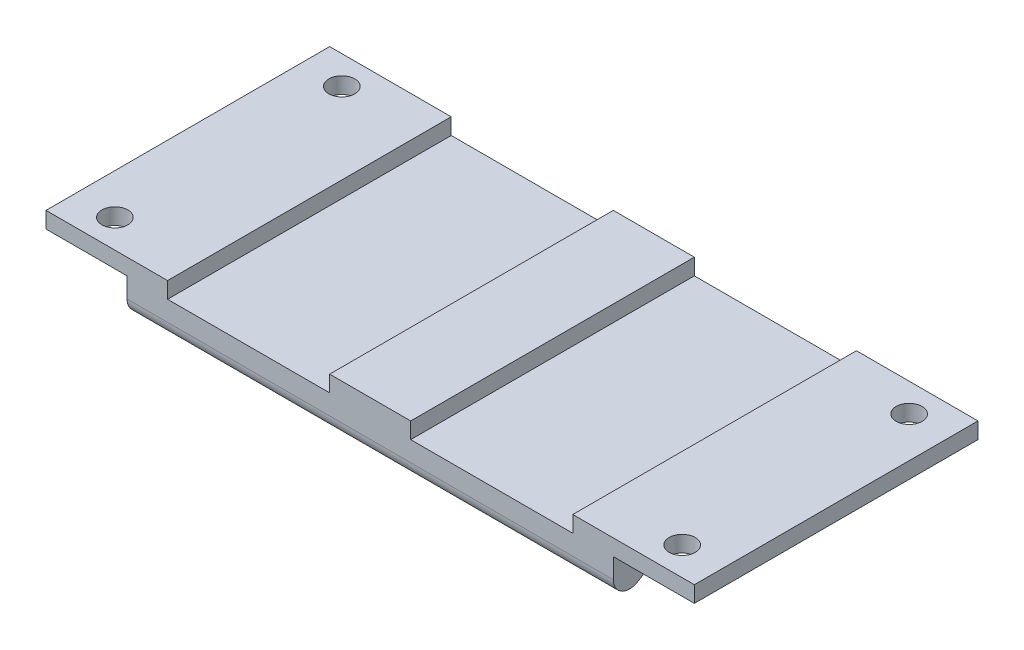
ISO-10303-21;
HEADER;
FILE_DESCRIPTION(('STEP AP214'),'2;1');
FILE_NAME('part.step','',(''),(''),'','','');
FILE_SCHEMA(('AUTOMOTIVE_DESIGN { 1 0 10303 214 1 1 1 1 }'));
ENDSEC;
DATA;
#1=APPLICATION_CONTEXT('core data for automotive mechanical design processes');
#2=APPLICATION_PROTOCOL_DEFINITION('international standard','automotive_design',2000,#1);
#3=PRODUCT_CONTEXT('',#1,'mechanical');
#4=PRODUCT('Part','Part','',(#3));
#5=PRODUCT_RELATED_PRODUCT_CATEGORY('part','',(#4));
#6=PRODUCT_DEFINITION_FORMATION('','',#4);
#7=PRODUCT_DEFINITION_CONTEXT('part definition',#1,'design');
#8=PRODUCT_DEFINITION('design','',#6,#7);
#9=PRODUCT_DEFINITION_SHAPE('','',#8);
#10=(LENGTH_UNIT() NAMED_UNIT(*) SI_UNIT(.MILLI.,.METRE.));
#11=(NAMED_UNIT(*) PLANE_ANGLE_UNIT() SI_UNIT($,.RADIAN.));
#12=(NAMED_UNIT(*) SI_UNIT($,.STERADIAN.) SOLID_ANGLE_UNIT());
#13=UNCERTAINTY_MEASURE_WITH_UNIT(LENGTH_MEASURE(1.E-05),#10,'distance_accuracy_value','');
#14=(GEOMETRIC_REPRESENTATION_CONTEXT(3) GLOBAL_UNCERTAINTY_ASSIGNED_CONTEXT((#13)) GLOBAL_UNIT_ASSIGNED_CONTEXT((#10,
#11,#12)) REPRESENTATION_CONTEXT('',''));
#15=CARTESIAN_POINT('',(0.,0.,0.));
#16=DIRECTION('',(0.,0.,1.));
#17=DIRECTION('',(1.,0.,0.));
#18=AXIS2_PLACEMENT_3D('',#15,#16,#17);
#19=CARTESIAN_POINT('',(0.,0.,0.));
#20=DIRECTION('',(0.,1.,0.));
#21=DIRECTION('',(0.,0.,1.));
#22=AXIS2_PLACEMENT_3D('',#19,#20,#21);
#23=PLANE('',#22);
#24=DIRECTION('',(-1.,0.,0.));
#25=VECTOR('',#24,1.);
#26=CARTESIAN_POINT('',(30.,0.,-17.5));
#27=LINE('',#26,#25);
#28=CARTESIAN_POINT('',(40.,0.,-17.5));
#29=VERTEX_POINT('',#28);
#30=CARTESIAN_POINT('',(25.,0.,-17.5));
#31=VERTEX_POINT('',#30);
#32=EDGE_CURVE('E188',#29,#31,#27,.T.);
#33=ORIENTED_EDGE('',*,*,#32,.T.);
#34=DIRECTION('',(0.,0.,1.));
#35=VECTOR('',#34,1.);
#36=CARTESIAN_POINT('',(25.,0.,-17.5));
#37=LINE('',#36,#35);
#38=CARTESIAN_POINT('',(25.,0.,17.5));
#39=VERTEX_POINT('',#38);
#40=EDGE_CURVE('E278',#31,#39,#37,.T.);
#41=ORIENTED_EDGE('',*,*,#40,.T.);
#42=DIRECTION('',(1.,0.,0.));
#43=VECTOR('',#42,1.);
#44=CARTESIAN_POINT('',(30.,0.,17.5));
#45=LINE('',#44,#43);
#46=CARTESIAN_POINT('',(40.,0.,17.5));
#47=VERTEX_POINT('',#46);
#48=EDGE_CURVE('E214',#39,#47,#45,.T.);
#49=ORIENTED_EDGE('',*,*,#48,.T.);
#50=DIRECTION('',(0.,0.,-1.));
#51=VECTOR('',#50,1.);
#52=CARTESIAN_POINT('',(40.,0.,0.));
#53=LINE('',#52,#51);
#54=EDGE_CURVE('E207',#47,#29,#53,.T.);
#55=ORIENTED_EDGE('',*,*,#54,.T.);
#56=EDGE_LOOP('',(#33,#41,#49,#55));
#57=FACE_BOUND('',#56,.T.);
#58=CARTESIAN_POINT('',(35.,0.,14.));
#59=DIRECTION('',(0.,1.,0.));
#60=DIRECTION('',(0.,0.,1.));
#61=AXIS2_PLACEMENT_3D('',#58,#59,#60);
#62=CIRCLE('',#61,1.6);
#63=CARTESIAN_POINT('',(35.,0.,15.6));
#64=VERTEX_POINT('',#63);
#65=EDGE_CURVE('E687',#64,#64,#62,.T.);
#66=ORIENTED_EDGE('',*,*,#65,.F.);
#67=EDGE_LOOP('',(#66));
#68=FACE_BOUND('',#67,.T.);
#69=CARTESIAN_POINT('',(35.,0.,-14.));
#70=DIRECTION('',(0.,1.,0.));
#71=DIRECTION('',(0.,0.,1.));
#72=AXIS2_PLACEMENT_3D('',#69,#70,#71);
#73=CIRCLE('',#72,1.6);
#74=CARTESIAN_POINT('',(35.,0.,-12.4));
#75=VERTEX_POINT('',#74);
#76=EDGE_CURVE('E683',#75,#75,#73,.F.);
#77=ORIENTED_EDGE('',*,*,#76,.T.);
#78=EDGE_LOOP('',(#77));
#79=FACE_BOUND('',#78,.T.);
#80=ADVANCED_FACE('F35',(#57,#68,#79),#23,.T.);
#81=DIRECTION('',(0.,0.,1.));
#82=VECTOR('',#81,1.);
#83=CARTESIAN_POINT('',(-25.,0.,-17.5));
#84=LINE('',#83,#82);
#85=CARTESIAN_POINT('',(-25.,0.,-17.5));
#86=VERTEX_POINT('',#85);
#87=CARTESIAN_POINT('',(-25.,0.,17.5));
#88=VERTEX_POINT('',#87);
#89=EDGE_CURVE('E267',#86,#88,#84,.T.);
#90=ORIENTED_EDGE('',*,*,#89,.F.);
#91=CARTESIAN_POINT('',(-40.,0.,-17.5));
#92=VERTEX_POINT('',#91);
#93=EDGE_CURVE('E202',#86,#92,#27,.T.);
#94=ORIENTED_EDGE('',*,*,#93,.T.);
#95=DIRECTION('',(0.,0.,-1.));
#96=VECTOR('',#95,1.);
#97=CARTESIAN_POINT('',(-40.,0.,0.));
#98=LINE('',#97,#96);
#99=CARTESIAN_POINT('',(-40.,0.,17.5));
#100=VERTEX_POINT('',#99);
#101=EDGE_CURVE('E233',#100,#92,#98,.T.);
#102=ORIENTED_EDGE('',*,*,#101,.F.);
#103=EDGE_CURVE('E307',#100,#88,#45,.T.);
#104=ORIENTED_EDGE('',*,*,#103,.T.);
#105=EDGE_LOOP('',(#90,#94,#102,#104));
#106=FACE_BOUND('',#105,.T.);
#107=CARTESIAN_POINT('',(-35.,0.,-14.));
#108=DIRECTION('',(0.,1.,0.));
#109=DIRECTION('',(0.,0.,1.));
#110=AXIS2_PLACEMENT_3D('',#107,#108,#109);
#111=CIRCLE('',#110,1.6);
#112=CARTESIAN_POINT('',(-35.,0.,-12.4));
#113=VERTEX_POINT('',#112);
#114=EDGE_CURVE('E360',#113,#113,#111,.T.);
#115=ORIENTED_EDGE('',*,*,#114,.F.);
#116=EDGE_LOOP('',(#115));
#117=FACE_BOUND('',#116,.T.);
#118=CARTESIAN_POINT('',(-35.,0.,14.));
#119=DIRECTION('',(0.,1.,0.));
#120=DIRECTION('',(0.,0.,1.));
#121=AXIS2_PLACEMENT_3D('',#118,#119,#120);
#122=CIRCLE('',#121,1.6);
#123=CARTESIAN_POINT('',(-35.,0.,15.6));
#124=VERTEX_POINT('',#123);
#125=EDGE_CURVE('E681',#124,#124,#122,.F.);
#126=ORIENTED_EDGE('',*,*,#125,.T.);
#127=EDGE_LOOP('',(#126));
#128=FACE_BOUND('',#127,.T.);
#129=ADVANCED_FACE('F374',(#106,#117,#128),#23,.T.);
#130=CARTESIAN_POINT('',(-40.,-2.,0.));
#131=DIRECTION('',(0.,1.,0.));
#132=DIRECTION('',(0.,0.,1.));
#133=AXIS2_PLACEMENT_3D('',#130,#131,#132);
#134=PLANE('',#133);
#135=CARTESIAN_POINT('',(-35.,-2.,-14.));
#136=DIRECTION('',(0.,1.,0.));
#137=DIRECTION('',(0.,0.,1.));
#138=AXIS2_PLACEMENT_3D('',#135,#136,#137);
#139=CIRCLE('',#138,1.6);
#140=CARTESIAN_POINT('',(-35.,-2.,-12.4));
#141=VERTEX_POINT('',#140);
#142=EDGE_CURVE('E362',#141,#141,#139,.T.);
#143=ORIENTED_EDGE('',*,*,#142,.T.);
#144=EDGE_LOOP('',(#143));
#145=FACE_BOUND('',#144,.T.);
#146=DIRECTION('',(0.,0.,1.));
#147=VECTOR('',#146,1.);
#148=CARTESIAN_POINT('',(-30.,-2.,0.));
#149=LINE('',#148,#147);
#150=CARTESIAN_POINT('',(-30.,-2.,-17.5));
#151=VERTEX_POINT('',#150);
#152=CARTESIAN_POINT('',(-30.,-2.,17.5));
#153=VERTEX_POINT('',#152);
#154=EDGE_CURVE('E60',#151,#153,#149,.T.);
#155=ORIENTED_EDGE('',*,*,#154,.T.);
#156=DIRECTION('',(1.,0.,0.));
#157=VECTOR('',#156,1.);
#158=CARTESIAN_POINT('',(-40.,-2.,17.5));
#159=LINE('',#158,#157);
#160=CARTESIAN_POINT('',(-40.,-2.,17.5));
#161=VERTEX_POINT('',#160);
#162=EDGE_CURVE('E236',#161,#153,#159,.T.);
#163=ORIENTED_EDGE('',*,*,#162,.F.);
#164=DIRECTION('',(0.,0.,1.));
#165=VECTOR('',#164,1.);
#166=CARTESIAN_POINT('',(-40.,-2.,0.));
#167=LINE('',#166,#165);
#168=CARTESIAN_POINT('',(-40.,-2.,-17.5));
#169=VERTEX_POINT('',#168);
#170=EDGE_CURVE('E228',#169,#161,#167,.T.);
#171=ORIENTED_EDGE('',*,*,#170,.F.);
#172=DIRECTION('',(1.,0.,0.));
#173=VECTOR('',#172,1.);
#174=CARTESIAN_POINT('',(-40.,-2.,-17.5));
#175=LINE('',#174,#173);
#176=EDGE_CURVE('E240',#169,#151,#175,.T.);
#177=ORIENTED_EDGE('',*,*,#176,.T.);
#178=EDGE_LOOP('',(#155,#163,#171,#177));
#179=FACE_BOUND('',#178,.T.);
#180=CARTESIAN_POINT('',(-35.,-2.,14.));
#181=DIRECTION('',(0.,1.,0.));
#182=DIRECTION('',(0.,0.,1.));
#183=AXIS2_PLACEMENT_3D('',#180,#181,#182);
#184=CIRCLE('',#183,1.6);
#185=CARTESIAN_POINT('',(-35.,-2.,15.6));
#186=VERTEX_POINT('',#185);
#187=EDGE_CURVE('E39',#186,#186,#184,.F.);
#188=ORIENTED_EDGE('',*,*,#187,.F.);
#189=EDGE_LOOP('',(#188));
#190=FACE_BOUND('',#189,.T.);
#191=ADVANCED_FACE('F371',(#145,#179,#190),#134,.F.);
#192=CARTESIAN_POINT('',(40.,-2.,0.));
#193=DIRECTION('',(0.,-1.,0.));
#194=DIRECTION('',(0.,0.,-1.));
#195=AXIS2_PLACEMENT_3D('',#192,#193,#194);
#196=PLANE('',#195);
#197=DIRECTION('',(0.,0.,1.));
#198=VECTOR('',#197,1.);
#199=CARTESIAN_POINT('',(30.,-2.,0.));
#200=LINE('',#199,#198);
#201=CARTESIAN_POINT('',(30.,-2.,-17.5));
#202=VERTEX_POINT('',#201);
#203=CARTESIAN_POINT('',(30.,-2.,17.5));
#204=VERTEX_POINT('',#203);
#205=EDGE_CURVE('E210',#202,#204,#200,.T.);
#206=ORIENTED_EDGE('',*,*,#205,.F.);
#207=DIRECTION('',(-1.,0.,0.));
#208=VECTOR('',#207,1.);
#209=CARTESIAN_POINT('',(40.,-2.,-17.5));
#210=LINE('',#209,#208);
#211=CARTESIAN_POINT('',(40.,-2.,-17.5));
#212=VERTEX_POINT('',#211);
#213=EDGE_CURVE('E221',#212,#202,#210,.T.);
#214=ORIENTED_EDGE('',*,*,#213,.F.);
#215=DIRECTION('',(0.,0.,1.));
#216=VECTOR('',#215,1.);
#217=CARTESIAN_POINT('',(40.,-2.,0.));
#218=LINE('',#217,#216);
#219=CARTESIAN_POINT('',(40.,-2.,17.5));
#220=VERTEX_POINT('',#219);
#221=EDGE_CURVE('E209',#212,#220,#218,.T.);
#222=ORIENTED_EDGE('',*,*,#221,.T.);
#223=DIRECTION('',(-1.,0.,0.));
#224=VECTOR('',#223,1.);
#225=CARTESIAN_POINT('',(40.,-2.,17.5));
#226=LINE('',#225,#224);
#227=EDGE_CURVE('E52',#220,#204,#226,.T.);
#228=ORIENTED_EDGE('',*,*,#227,.T.);
#229=EDGE_LOOP('',(#206,#214,#222,#228));
#230=FACE_BOUND('',#229,.T.);
#231=CARTESIAN_POINT('',(35.,-2.,14.));
#232=DIRECTION('',(0.,-1.,0.));
#233=DIRECTION('',(0.,0.,-1.));
#234=AXIS2_PLACEMENT_3D('',#231,#232,#233);
#235=CIRCLE('',#234,1.6);
#236=CARTESIAN_POINT('',(35.,-2.,12.4));
#237=VERTEX_POINT('',#236);
#238=EDGE_CURVE('E356',#237,#237,#235,.T.);
#239=ORIENTED_EDGE('',*,*,#238,.F.);
#240=EDGE_LOOP('',(#239));
#241=FACE_BOUND('',#240,.T.);
#242=CARTESIAN_POINT('',(35.,-2.,-14.));
#243=DIRECTION('',(0.,-1.,0.));
#244=DIRECTION('',(0.,0.,-1.));
#245=AXIS2_PLACEMENT_3D('',#242,#243,#244);
#246=CIRCLE('',#245,1.6);
#247=CARTESIAN_POINT('',(35.,-2.,-15.6));
#248=VERTEX_POINT('',#247);
#249=EDGE_CURVE('E359',#248,#248,#246,.F.);
#250=ORIENTED_EDGE('',*,*,#249,.T.);
#251=EDGE_LOOP('',(#250));
#252=FACE_BOUND('',#251,.T.);
#253=ADVANCED_FACE('F373',(#230,#241,#252),#196,.T.);
#254=CARTESIAN_POINT('',(30.,-8.,17.5));
#255=DIRECTION('',(1.,0.,0.));
#256=DIRECTION('',(0.,0.,-1.));
#257=AXIS2_PLACEMENT_3D('',#254,#255,#256);
#258=PLANE('',#257);
#259=DIRECTION('',(0.,1.,0.));
#260=VECTOR('',#259,1.);
#261=CARTESIAN_POINT('',(30.,-8.,-17.5));
#262=LINE('',#261,#260);
#263=CARTESIAN_POINT('',(30.,-4.46761924206188,-17.5));
#264=VERTEX_POINT('',#263);
#265=EDGE_CURVE('E314',#264,#202,#262,.T.);
#266=ORIENTED_EDGE('',*,*,#265,.T.);
#267=ORIENTED_EDGE('',*,*,#205,.T.);
#268=DIRECTION('',(0.,1.,0.));
#269=VECTOR('',#268,1.);
#270=CARTESIAN_POINT('',(30.,-8.,17.5));
#271=LINE('',#270,#269);
#272=CARTESIAN_POINT('',(30.,-4.46761924206188,17.5));
#273=VERTEX_POINT('',#272);
#274=EDGE_CURVE('E317',#273,#204,#271,.T.);
#275=ORIENTED_EDGE('',*,*,#274,.F.);
#276=CARTESIAN_POINT('',(30.,-4.46761924206188,15.5));
#277=DIRECTION('',(1.,0.,0.));
#278=DIRECTION('',(0.,0.,-1.));
#279=AXIS2_PLACEMENT_3D('',#276,#277,#278);
#280=CIRCLE('',#279,2.);
#281=CARTESIAN_POINT('',(30.,-6.18260509348697,14.4710084891449));
#282=VERTEX_POINT('',#281);
#283=EDGE_CURVE('E344',#273,#282,#280,.T.);
#284=ORIENTED_EDGE('',*,*,#283,.T.);
#285=DIRECTION('',(0.,0.514495755427526,-0.857492925712544));
#286=VECTOR('',#285,1.);
#287=CARTESIAN_POINT('',(30.,-8.,17.5));
#288=LINE('',#287,#286);
#289=CARTESIAN_POINT('',(30.,-5.28501414857491,12.9750235809582));
#290=VERTEX_POINT('',#289);
#291=EDGE_CURVE('E304',#282,#290,#288,.T.);
#292=ORIENTED_EDGE('',*,*,#291,.T.);
#293=CARTESIAN_POINT('',(30.,-7.,11.9460320701031));
#294=DIRECTION('',(1.,0.,0.));
#295=DIRECTION('',(0.,0.,-1.));
#296=AXIS2_PLACEMENT_3D('',#293,#294,#295);
#297=CIRCLE('',#296,2.);
#298=CARTESIAN_POINT('',(30.,-5.,11.9460320701031));
#299=VERTEX_POINT('',#298);
#300=EDGE_CURVE('E351',#290,#299,#297,.F.);
#301=ORIENTED_EDGE('',*,*,#300,.T.);
#302=DIRECTION('',(0.,0.,-1.));
#303=VECTOR('',#302,1.);
#304=CARTESIAN_POINT('',(30.,-5.,17.5));
#305=LINE('',#304,#303);
#306=CARTESIAN_POINT('',(30.,-5.,-11.9460320701031));
#307=VERTEX_POINT('',#306);
#308=EDGE_CURVE('E313',#299,#307,#305,.T.);
#309=ORIENTED_EDGE('',*,*,#308,.T.);
#310=CARTESIAN_POINT('',(30.,-7.,-11.9460320701031));
#311=DIRECTION('',(1.,0.,0.));
#312=DIRECTION('',(0.,0.,-1.));
#313=AXIS2_PLACEMENT_3D('',#310,#311,#312);
#314=CIRCLE('',#313,2.);
#315=CARTESIAN_POINT('',(30.,-5.28501414857491,-12.9750235809582));
#316=VERTEX_POINT('',#315);
#317=EDGE_CURVE('E44',#307,#316,#314,.F.);
#318=ORIENTED_EDGE('',*,*,#317,.T.);
#319=DIRECTION('',(0.,0.514495755427527,0.857492925712544));
#320=VECTOR('',#319,1.);
#321=CARTESIAN_POINT('',(30.,7.44117647058825,8.23529411764705));
#322=LINE('',#321,#320);
#323=CARTESIAN_POINT('',(30.,-6.18260509348696,-14.471008489145));
#324=VERTEX_POINT('',#323);
#325=EDGE_CURVE('E301',#324,#316,#322,.T.);
#326=ORIENTED_EDGE('',*,*,#325,.F.);
#327=CARTESIAN_POINT('',(30.,-4.46761924206188,-15.5));
#328=DIRECTION('',(1.,0.,0.));
#329=DIRECTION('',(0.,0.,-1.));
#330=AXIS2_PLACEMENT_3D('',#327,#328,#329);
#331=CIRCLE('',#330,2.);
#332=EDGE_CURVE('E346',#324,#264,#331,.T.);
#333=ORIENTED_EDGE('',*,*,#332,.T.);
#334=EDGE_LOOP('',(#266,#267,#275,#284,#292,#301,#309,#318,#326,#333));
#335=FACE_BOUND('',#334,.T.);
#336=ADVANCED_FACE('F380',(#335),#258,.T.);
#337=CARTESIAN_POINT('',(30.,-8.,-17.5));
#338=DIRECTION('',(0.,0.,-1.));
#339=DIRECTION('',(-1.,0.,0.));
#340=AXIS2_PLACEMENT_3D('',#337,#338,#339);
#341=PLANE('',#340);
#342=DIRECTION('',(1.,0.,0.));
#343=VECTOR('',#342,1.);
#344=CARTESIAN_POINT('',(0.,-2.,-17.5));
#345=LINE('',#344,#343);
#346=CARTESIAN_POINT('',(-25.,-2.,-17.5));
#347=VERTEX_POINT('',#346);
#348=CARTESIAN_POINT('',(-4.99999999999999,-2.,-17.5));
#349=VERTEX_POINT('',#348);
#350=EDGE_CURVE('E250',#347,#349,#345,.T.);
#351=ORIENTED_EDGE('',*,*,#350,.T.);
#352=DIRECTION('',(0.,-1.,0.));
#353=VECTOR('',#352,1.);
#354=CARTESIAN_POINT('',(-5.,0.,-17.5));
#355=LINE('',#354,#353);
#356=CARTESIAN_POINT('',(-5.,0.,-17.5));
#357=VERTEX_POINT('',#356);
#358=EDGE_CURVE('E244',#357,#349,#355,.T.);
#359=ORIENTED_EDGE('',*,*,#358,.F.);
#360=CARTESIAN_POINT('',(5.,0.,-17.5));
#361=VERTEX_POINT('',#360);
#362=EDGE_CURVE('E200',#361,#357,#27,.T.);
#363=ORIENTED_EDGE('',*,*,#362,.F.);
#364=DIRECTION('',(0.,-1.,0.));
#365=VECTOR('',#364,1.);
#366=CARTESIAN_POINT('',(5.,0.,-17.5));
#367=LINE('',#366,#365);
#368=CARTESIAN_POINT('',(5.,-2.,-17.5));
#369=VERTEX_POINT('',#368);
#370=EDGE_CURVE('E272',#361,#369,#367,.T.);
#371=ORIENTED_EDGE('',*,*,#370,.T.);
#372=DIRECTION('',(-1.,0.,0.));
#373=VECTOR('',#372,1.);
#374=CARTESIAN_POINT('',(0.,-2.,-17.5));
#375=LINE('',#374,#373);
#376=CARTESIAN_POINT('',(25.,-1.99999999999999,-17.5));
#377=VERTEX_POINT('',#376);
#378=EDGE_CURVE('E276',#377,#369,#375,.T.);
#379=ORIENTED_EDGE('',*,*,#378,.F.);
#380=DIRECTION('',(0.,-1.,0.));
#381=VECTOR('',#380,1.);
#382=CARTESIAN_POINT('',(25.,0.,-17.5));
#383=LINE('',#382,#381);
#384=EDGE_CURVE('E195',#31,#377,#383,.T.);
#385=ORIENTED_EDGE('',*,*,#384,.F.);
#386=ORIENTED_EDGE('',*,*,#32,.F.);
#387=DIRECTION('',(0.,-1.,0.));
#388=VECTOR('',#387,1.);
#389=CARTESIAN_POINT('',(40.,0.,-17.5));
#390=LINE('',#389,#388);
#391=EDGE_CURVE('E192',#29,#212,#390,.T.);
#392=ORIENTED_EDGE('',*,*,#391,.T.);
#393=ORIENTED_EDGE('',*,*,#213,.T.);
#394=ORIENTED_EDGE('',*,*,#265,.F.);
#395=DIRECTION('',(-1.,0.,0.));
#396=VECTOR('',#395,1.);
#397=CARTESIAN_POINT('',(-30.,-4.46761924206187,-17.5));
#398=LINE('',#397,#396);
#399=CARTESIAN_POINT('',(-30.,-4.46761924206187,-17.5));
#400=VERTEX_POINT('',#399);
#401=EDGE_CURVE('E337',#264,#400,#398,.T.);
#402=ORIENTED_EDGE('',*,*,#401,.T.);
#403=DIRECTION('',(0.,1.,0.));
#404=VECTOR('',#403,1.);
#405=CARTESIAN_POINT('',(-30.,-8.,-17.5));
#406=LINE('',#405,#404);
#407=EDGE_CURVE('E311',#400,#151,#406,.T.);
#408=ORIENTED_EDGE('',*,*,#407,.T.);
#409=ORIENTED_EDGE('',*,*,#176,.F.);
#410=DIRECTION('',(0.,-1.,0.));
#411=VECTOR('',#410,1.);
#412=CARTESIAN_POINT('',(-40.,0.,-17.5));
#413=LINE('',#412,#411);
#414=EDGE_CURVE('E225',#92,#169,#413,.T.);
#415=ORIENTED_EDGE('',*,*,#414,.F.);
#416=ORIENTED_EDGE('',*,*,#93,.F.);
#417=DIRECTION('',(0.,-1.,0.));
#418=VECTOR('',#417,1.);
#419=CARTESIAN_POINT('',(-25.,0.,-17.5));
#420=LINE('',#419,#418);
#421=EDGE_CURVE('E246',#86,#347,#420,.T.);
#422=ORIENTED_EDGE('',*,*,#421,.T.);
#423=EDGE_LOOP('',(#351,#359,#363,#371,#379,#385,#386,#392,#393,#394,#402,#408,#409,#415,#416,#422));
#424=FACE_BOUND('',#423,.T.);
#425=ADVANCED_FACE('F191',(#424),#341,.T.);
#426=CARTESIAN_POINT('',(30.,-8.,17.5));
#427=DIRECTION('',(0.,0.,1.));
#428=DIRECTION('',(1.,0.,0.));
#429=AXIS2_PLACEMENT_3D('',#426,#427,#428);
#430=PLANE('',#429);
#431=CARTESIAN_POINT('',(-5.,0.,17.5));
#432=VERTEX_POINT('',#431);
#433=CARTESIAN_POINT('',(5.,0.,17.5));
#434=VERTEX_POINT('',#433);
#435=EDGE_CURVE('E309',#432,#434,#45,.T.);
#436=ORIENTED_EDGE('',*,*,#435,.F.);
#437=DIRECTION('',(0.,-1.,0.));
#438=VECTOR('',#437,1.);
#439=CARTESIAN_POINT('',(-5.,0.,17.5));
#440=LINE('',#439,#438);
#441=CARTESIAN_POINT('',(-4.99999999999999,-2.,17.5));
#442=VERTEX_POINT('',#441);
#443=EDGE_CURVE('E253',#432,#442,#440,.T.);
#444=ORIENTED_EDGE('',*,*,#443,.T.);
#445=DIRECTION('',(1.,0.,0.));
#446=VECTOR('',#445,1.);
#447=CARTESIAN_POINT('',(0.,-2.,17.5));
#448=LINE('',#447,#446);
#449=CARTESIAN_POINT('',(-25.,-2.,17.5));
#450=VERTEX_POINT('',#449);
#451=EDGE_CURVE('E247',#450,#442,#448,.T.);
#452=ORIENTED_EDGE('',*,*,#451,.F.);
#453=DIRECTION('',(0.,-1.,0.));
#454=VECTOR('',#453,1.);
#455=CARTESIAN_POINT('',(-25.,0.,17.5));
#456=LINE('',#455,#454);
#457=EDGE_CURVE('E256',#88,#450,#456,.T.);
#458=ORIENTED_EDGE('',*,*,#457,.F.);
#459=ORIENTED_EDGE('',*,*,#103,.F.);
#460=DIRECTION('',(0.,1.,0.));
#461=VECTOR('',#460,1.);
#462=CARTESIAN_POINT('',(-40.,0.,17.5));
#463=LINE('',#462,#461);
#464=EDGE_CURVE('E230',#161,#100,#463,.T.);
#465=ORIENTED_EDGE('',*,*,#464,.F.);
#466=ORIENTED_EDGE('',*,*,#162,.T.);
#467=DIRECTION('',(0.,1.,0.));
#468=VECTOR('',#467,1.);
#469=CARTESIAN_POINT('',(-30.,-8.,17.5));
#470=LINE('',#469,#468);
#471=CARTESIAN_POINT('',(-30.,-4.46761924206188,17.5));
#472=VERTEX_POINT('',#471);
#473=EDGE_CURVE('E199',#472,#153,#470,.T.);
#474=ORIENTED_EDGE('',*,*,#473,.F.);
#475=DIRECTION('',(1.,0.,0.));
#476=VECTOR('',#475,1.);
#477=CARTESIAN_POINT('',(30.,-4.46761924206188,17.5));
#478=LINE('',#477,#476);
#479=EDGE_CURVE('E348',#472,#273,#478,.T.);
#480=ORIENTED_EDGE('',*,*,#479,.T.);
#481=ORIENTED_EDGE('',*,*,#274,.T.);
#482=ORIENTED_EDGE('',*,*,#227,.F.);
#483=DIRECTION('',(0.,1.,0.));
#484=VECTOR('',#483,1.);
#485=CARTESIAN_POINT('',(40.,0.,17.5));
#486=LINE('',#485,#484);
#487=EDGE_CURVE('E215',#220,#47,#486,.T.);
#488=ORIENTED_EDGE('',*,*,#487,.T.);
#489=ORIENTED_EDGE('',*,*,#48,.F.);
#490=DIRECTION('',(0.,-1.,0.));
#491=VECTOR('',#490,1.);
#492=CARTESIAN_POINT('',(25.,0.,17.5));
#493=LINE('',#492,#491);
#494=CARTESIAN_POINT('',(25.,-1.99999999999999,17.5));
#495=VERTEX_POINT('',#494);
#496=EDGE_CURVE('E243',#39,#495,#493,.T.);
#497=ORIENTED_EDGE('',*,*,#496,.T.);
#498=DIRECTION('',(-1.,0.,0.));
#499=VECTOR('',#498,1.);
#500=CARTESIAN_POINT('',(0.,-2.,17.5));
#501=LINE('',#500,#499);
#502=CARTESIAN_POINT('',(5.,-2.,17.5));
#503=VERTEX_POINT('',#502);
#504=EDGE_CURVE('E273',#495,#503,#501,.T.);
#505=ORIENTED_EDGE('',*,*,#504,.T.);
#506=DIRECTION('',(0.,-1.,0.));
#507=VECTOR('',#506,1.);
#508=CARTESIAN_POINT('',(5.,0.,17.5));
#509=LINE('',#508,#507);
#510=EDGE_CURVE('E281',#434,#503,#509,.T.);
#511=ORIENTED_EDGE('',*,*,#510,.F.);
#512=EDGE_LOOP('',(#436,#444,#452,#458,#459,#465,#466,#474,#480,#481,#482,#488,#489,#497,#505,#511));
#513=FACE_BOUND('',#512,.T.);
#514=ADVANCED_FACE('F395',(#513),#430,.T.);
#515=ORIENTED_EDGE('',*,*,#362,.T.);
#516=DIRECTION('',(0.,0.,1.));
#517=VECTOR('',#516,1.);
#518=CARTESIAN_POINT('',(-5.,0.,-17.5));
#519=LINE('',#518,#517);
#520=EDGE_CURVE('E252',#357,#432,#519,.T.);
#521=ORIENTED_EDGE('',*,*,#520,.T.);
#522=ORIENTED_EDGE('',*,*,#435,.T.);
#523=DIRECTION('',(0.,0.,1.));
#524=VECTOR('',#523,1.);
#525=CARTESIAN_POINT('',(5.,0.,-17.5));
#526=LINE('',#525,#524);
#527=EDGE_CURVE('E290',#361,#434,#526,.T.);
#528=ORIENTED_EDGE('',*,*,#527,.F.);
#529=EDGE_LOOP('',(#515,#521,#522,#528));
#530=FACE_BOUND('',#529,.T.);
#531=ADVANCED_FACE('F384',(#530),#23,.T.);
#532=CARTESIAN_POINT('',(-30.,-8.,17.5));
#533=DIRECTION('',(-1.,0.,0.));
#534=DIRECTION('',(0.,0.,1.));
#535=AXIS2_PLACEMENT_3D('',#532,#533,#534);
#536=PLANE('',#535);
#537=ORIENTED_EDGE('',*,*,#154,.F.);
#538=ORIENTED_EDGE('',*,*,#407,.F.);
#539=CARTESIAN_POINT('',(-30.,-4.46761924206187,-15.5));
#540=DIRECTION('',(-1.,0.,0.));
#541=DIRECTION('',(0.,0.,1.));
#542=AXIS2_PLACEMENT_3D('',#539,#540,#541);
#543=CIRCLE('',#542,2.);
#544=CARTESIAN_POINT('',(-30.,-6.18260509348696,-14.4710084891449));
#545=VERTEX_POINT('',#544);
#546=EDGE_CURVE('E342',#400,#545,#543,.T.);
#547=ORIENTED_EDGE('',*,*,#546,.T.);
#548=DIRECTION('',(0.,0.514495755427527,0.857492925712544));
#549=VECTOR('',#548,1.);
#550=CARTESIAN_POINT('',(-30.,1.83823529411765,-1.10294117647059));
#551=LINE('',#550,#549);
#552=CARTESIAN_POINT('',(-30.,-5.28501414857491,-12.9750235809582));
#553=VERTEX_POINT('',#552);
#554=EDGE_CURVE('E264',#545,#553,#551,.T.);
#555=ORIENTED_EDGE('',*,*,#554,.T.);
#556=CARTESIAN_POINT('',(-30.,-7.,-11.9460320701031));
#557=DIRECTION('',(-1.,0.,0.));
#558=DIRECTION('',(0.,0.,1.));
#559=AXIS2_PLACEMENT_3D('',#556,#557,#558);
#560=CIRCLE('',#559,2.);
#561=CARTESIAN_POINT('',(-30.,-5.,-11.9460320701031));
#562=VERTEX_POINT('',#561);
#563=EDGE_CURVE('E11',#553,#562,#560,.F.);
#564=ORIENTED_EDGE('',*,*,#563,.T.);
#565=DIRECTION('',(0.,0.,-1.));
#566=VECTOR('',#565,1.);
#567=CARTESIAN_POINT('',(-30.,-5.,0.));
#568=LINE('',#567,#566);
#569=CARTESIAN_POINT('',(-30.,-5.,11.9460320701031));
#570=VERTEX_POINT('',#569);
#571=EDGE_CURVE('E295',#570,#562,#568,.T.);
#572=ORIENTED_EDGE('',*,*,#571,.F.);
#573=CARTESIAN_POINT('',(-30.,-7.,11.9460320701031));
#574=DIRECTION('',(-1.,0.,0.));
#575=DIRECTION('',(0.,0.,1.));
#576=AXIS2_PLACEMENT_3D('',#573,#574,#575);
#577=CIRCLE('',#576,2.);
#578=CARTESIAN_POINT('',(-30.,-5.28501414857491,12.9750235809582));
#579=VERTEX_POINT('',#578);
#580=EDGE_CURVE('E353',#570,#579,#577,.F.);
#581=ORIENTED_EDGE('',*,*,#580,.T.);
#582=DIRECTION('',(0.,0.514495755427526,-0.857492925712544));
#583=VECTOR('',#582,1.);
#584=CARTESIAN_POINT('',(-30.,1.83823529411765,1.10294117647059));
#585=LINE('',#584,#583);
#586=CARTESIAN_POINT('',(-30.,-6.18260509348697,14.471008489145));
#587=VERTEX_POINT('',#586);
#588=EDGE_CURVE('E298',#587,#579,#585,.T.);
#589=ORIENTED_EDGE('',*,*,#588,.F.);
#590=CARTESIAN_POINT('',(-30.,-4.46761924206188,15.5));
#591=DIRECTION('',(-1.,0.,0.));
#592=DIRECTION('',(0.,0.,1.));
#593=AXIS2_PLACEMENT_3D('',#590,#591,#592);
#594=CIRCLE('',#593,2.);
#595=EDGE_CURVE('E340',#587,#472,#594,.T.);
#596=ORIENTED_EDGE('',*,*,#595,.T.);
#597=ORIENTED_EDGE('',*,*,#473,.T.);
#598=EDGE_LOOP('',(#537,#538,#547,#555,#564,#572,#581,#589,#596,#597));
#599=FACE_BOUND('',#598,.T.);
#600=ADVANCED_FACE('F394',(#599),#536,.T.);
#601=CARTESIAN_POINT('',(-30.,1.83823529411765,1.10294117647059));
#602=DIRECTION('',(0.,-0.857492925712544,-0.514495755427526));
#603=DIRECTION('',(0.,0.514495755427526,-0.857492925712544));
#604=AXIS2_PLACEMENT_3D('',#601,#602,#603);
#605=PLANE('',#604);
#606=ORIENTED_EDGE('',*,*,#588,.T.);
#607=DIRECTION('',(1.,0.,0.));
#608=VECTOR('',#607,1.);
#609=CARTESIAN_POINT('',(30.,-5.28501414857491,12.9750235809582));
#610=LINE('',#609,#608);
#611=EDGE_CURVE('E325',#579,#290,#610,.T.);
#612=ORIENTED_EDGE('',*,*,#611,.T.);
#613=ORIENTED_EDGE('',*,*,#291,.F.);
#614=DIRECTION('',(1.,0.,0.));
#615=VECTOR('',#614,1.);
#616=CARTESIAN_POINT('',(-30.,-6.18260509348697,14.471008489145));
#617=LINE('',#616,#615);
#618=EDGE_CURVE('E323',#282,#587,#617,.F.);
#619=ORIENTED_EDGE('',*,*,#618,.T.);
#620=EDGE_LOOP('',(#606,#612,#613,#619));
#621=FACE_BOUND('',#620,.T.);
#622=ADVANCED_FACE('F401',(#621),#605,.T.);
#623=CARTESIAN_POINT('',(-30.,-5.,0.));
#624=DIRECTION('',(0.,-1.,0.));
#625=DIRECTION('',(0.,0.,-1.));
#626=AXIS2_PLACEMENT_3D('',#623,#624,#625);
#627=PLANE('',#626);
#628=ORIENTED_EDGE('',*,*,#308,.F.);
#629=DIRECTION('',(1.,0.,0.));
#630=VECTOR('',#629,1.);
#631=CARTESIAN_POINT('',(-30.,-5.,11.9460320701031));
#632=LINE('',#631,#630);
#633=EDGE_CURVE('E331',#299,#570,#632,.F.);
#634=ORIENTED_EDGE('',*,*,#633,.T.);
#635=ORIENTED_EDGE('',*,*,#571,.T.);
#636=DIRECTION('',(1.,0.,0.));
#637=VECTOR('',#636,1.);
#638=CARTESIAN_POINT('',(-30.,-5.,-11.9460320701031));
#639=LINE('',#638,#637);
#640=EDGE_CURVE('E328',#562,#307,#639,.T.);
#641=ORIENTED_EDGE('',*,*,#640,.T.);
#642=EDGE_LOOP('',(#628,#634,#635,#641));
#643=FACE_BOUND('',#642,.T.);
#644=ADVANCED_FACE('F462',(#643),#627,.T.);
#645=CARTESIAN_POINT('',(-30.,1.83823529411765,-1.10294117647059));
#646=DIRECTION('',(0.,0.857492925712544,-0.514495755427527));
#647=DIRECTION('',(0.,0.514495755427527,0.857492925712544));
#648=AXIS2_PLACEMENT_3D('',#645,#646,#647);
#649=PLANE('',#648);
#650=ORIENTED_EDGE('',*,*,#325,.T.);
#651=DIRECTION('',(1.,0.,0.));
#652=VECTOR('',#651,1.);
#653=CARTESIAN_POINT('',(-30.,-5.28501414857491,-12.9750235809582));
#654=LINE('',#653,#652);
#655=EDGE_CURVE('E335',#316,#553,#654,.F.);
#656=ORIENTED_EDGE('',*,*,#655,.T.);
#657=ORIENTED_EDGE('',*,*,#554,.F.);
#658=DIRECTION('',(-1.,0.,0.));
#659=VECTOR('',#658,1.);
#660=CARTESIAN_POINT('',(30.,-6.18260509348697,-14.4710084891449));
#661=LINE('',#660,#659);
#662=EDGE_CURVE('E333',#545,#324,#661,.F.);
#663=ORIENTED_EDGE('',*,*,#662,.T.);
#664=EDGE_LOOP('',(#650,#656,#657,#663));
#665=FACE_BOUND('',#664,.T.);
#666=ADVANCED_FACE('F452',(#665),#649,.F.);
#667=CARTESIAN_POINT('',(-30.,-7.,11.9460320701031));
#668=DIRECTION('',(-1.,0.,0.));
#669=DIRECTION('',(0.,0.,1.));
#670=AXIS2_PLACEMENT_3D('',#667,#668,#669);
#671=CYLINDRICAL_SURFACE('',#670,2.);
#672=ORIENTED_EDGE('',*,*,#580,.F.);
#673=ORIENTED_EDGE('',*,*,#633,.F.);
#674=ORIENTED_EDGE('',*,*,#300,.F.);
#675=ORIENTED_EDGE('',*,*,#611,.F.);
#676=EDGE_LOOP('',(#672,#673,#674,#675));
#677=FACE_BOUND('',#676,.T.);
#678=ADVANCED_FACE('F465',(#677),#671,.F.);
#679=CARTESIAN_POINT('',(-30.,-7.,-11.9460320701031));
#680=DIRECTION('',(1.,0.,0.));
#681=DIRECTION('',(0.,0.,-1.));
#682=AXIS2_PLACEMENT_3D('',#679,#680,#681);
#683=CYLINDRICAL_SURFACE('',#682,2.);
#684=ORIENTED_EDGE('',*,*,#563,.F.);
#685=ORIENTED_EDGE('',*,*,#655,.F.);
#686=ORIENTED_EDGE('',*,*,#317,.F.);
#687=ORIENTED_EDGE('',*,*,#640,.F.);
#688=EDGE_LOOP('',(#684,#685,#686,#687));
#689=FACE_BOUND('',#688,.T.);
#690=ADVANCED_FACE('F456',(#689),#683,.F.);
#691=CARTESIAN_POINT('',(30.,-4.46761924206188,-15.5));
#692=DIRECTION('',(1.,0.,0.));
#693=DIRECTION('',(0.,0.,-1.));
#694=AXIS2_PLACEMENT_3D('',#691,#692,#693);
#695=CYLINDRICAL_SURFACE('',#694,2.);
#696=ORIENTED_EDGE('',*,*,#332,.F.);
#697=ORIENTED_EDGE('',*,*,#662,.F.);
#698=ORIENTED_EDGE('',*,*,#546,.F.);
#699=ORIENTED_EDGE('',*,*,#401,.F.);
#700=EDGE_LOOP('',(#696,#697,#698,#699));
#701=FACE_BOUND('',#700,.T.);
#702=ADVANCED_FACE('F447',(#701),#695,.T.);
#703=CARTESIAN_POINT('',(30.,-4.46761924206188,15.5));
#704=DIRECTION('',(1.,0.,0.));
#705=DIRECTION('',(0.,0.,-1.));
#706=AXIS2_PLACEMENT_3D('',#703,#704,#705);
#707=CYLINDRICAL_SURFACE('',#706,2.);
#708=ORIENTED_EDGE('',*,*,#595,.F.);
#709=ORIENTED_EDGE('',*,*,#618,.F.);
#710=ORIENTED_EDGE('',*,*,#283,.F.);
#711=ORIENTED_EDGE('',*,*,#479,.F.);
#712=EDGE_LOOP('',(#708,#709,#710,#711));
#713=FACE_BOUND('',#712,.T.);
#714=ADVANCED_FACE('F37',(#713),#707,.T.);
#715=CARTESIAN_POINT('',(25.,0.,-17.5));
#716=DIRECTION('',(-1.,0.,0.));
#717=DIRECTION('',(0.,0.,1.));
#718=AXIS2_PLACEMENT_3D('',#715,#716,#717);
#719=PLANE('',#718);
#720=ORIENTED_EDGE('',*,*,#496,.F.);
#721=ORIENTED_EDGE('',*,*,#40,.F.);
#722=ORIENTED_EDGE('',*,*,#384,.T.);
#723=DIRECTION('',(0.,0.,1.));
#724=VECTOR('',#723,1.);
#725=CARTESIAN_POINT('',(25.,-1.99999999999999,-17.5));
#726=LINE('',#725,#724);
#727=EDGE_CURVE('E257',#377,#495,#726,.T.);
#728=ORIENTED_EDGE('',*,*,#727,.T.);
#729=EDGE_LOOP('',(#720,#721,#722,#728));
#730=FACE_BOUND('',#729,.T.);
#731=ADVANCED_FACE('F440',(#730),#719,.T.);
#732=CARTESIAN_POINT('',(0.,-2.,-17.5));
#733=DIRECTION('',(0.,1.,0.));
#734=DIRECTION('',(-1.,0.,0.));
#735=AXIS2_PLACEMENT_3D('',#732,#733,#734);
#736=PLANE('',#735);
#737=ORIENTED_EDGE('',*,*,#504,.F.);
#738=ORIENTED_EDGE('',*,*,#727,.F.);
#739=ORIENTED_EDGE('',*,*,#378,.T.);
#740=DIRECTION('',(0.,0.,1.));
#741=VECTOR('',#740,1.);
#742=CARTESIAN_POINT('',(5.,-2.,-17.5));
#743=LINE('',#742,#741);
#744=EDGE_CURVE('E288',#369,#503,#743,.T.);
#745=ORIENTED_EDGE('',*,*,#744,.T.);
#746=EDGE_LOOP('',(#737,#738,#739,#745));
#747=FACE_BOUND('',#746,.T.);
#748=ADVANCED_FACE('F438',(#747),#736,.T.);
#749=CARTESIAN_POINT('',(5.,0.,-17.5));
#750=DIRECTION('',(-1.,0.,0.));
#751=DIRECTION('',(0.,-1.,0.));
#752=AXIS2_PLACEMENT_3D('',#749,#750,#751);
#753=PLANE('',#752);
#754=ORIENTED_EDGE('',*,*,#510,.T.);
#755=ORIENTED_EDGE('',*,*,#744,.F.);
#756=ORIENTED_EDGE('',*,*,#370,.F.);
#757=ORIENTED_EDGE('',*,*,#527,.T.);
#758=EDGE_LOOP('',(#754,#755,#756,#757));
#759=FACE_BOUND('',#758,.T.);
#760=ADVANCED_FACE('F435',(#759),#753,.F.);
#761=CARTESIAN_POINT('',(-5.,0.,-17.5));
#762=DIRECTION('',(-1.,0.,0.));
#763=DIRECTION('',(0.,-1.,0.));
#764=AXIS2_PLACEMENT_3D('',#761,#762,#763);
#765=PLANE('',#764);
#766=ORIENTED_EDGE('',*,*,#443,.F.);
#767=ORIENTED_EDGE('',*,*,#520,.F.);
#768=ORIENTED_EDGE('',*,*,#358,.T.);
#769=DIRECTION('',(0.,0.,1.));
#770=VECTOR('',#769,1.);
#771=CARTESIAN_POINT('',(-4.99999999999999,-2.,-17.5));
#772=LINE('',#771,#770);
#773=EDGE_CURVE('E262',#349,#442,#772,.T.);
#774=ORIENTED_EDGE('',*,*,#773,.T.);
#775=EDGE_LOOP('',(#766,#767,#768,#774));
#776=FACE_BOUND('',#775,.T.);
#777=ADVANCED_FACE('F431',(#776),#765,.T.);
#778=CARTESIAN_POINT('',(0.,-2.,-17.5));
#779=DIRECTION('',(0.,-1.,0.));
#780=DIRECTION('',(0.,0.,-1.));
#781=AXIS2_PLACEMENT_3D('',#778,#779,#780);
#782=PLANE('',#781);
#783=ORIENTED_EDGE('',*,*,#451,.T.);
#784=ORIENTED_EDGE('',*,*,#773,.F.);
#785=ORIENTED_EDGE('',*,*,#350,.F.);
#786=DIRECTION('',(0.,0.,1.));
#787=VECTOR('',#786,1.);
#788=CARTESIAN_POINT('',(-25.,-2.,-17.5));
#789=LINE('',#788,#787);
#790=EDGE_CURVE('E265',#347,#450,#789,.T.);
#791=ORIENTED_EDGE('',*,*,#790,.T.);
#792=EDGE_LOOP('',(#783,#784,#785,#791));
#793=FACE_BOUND('',#792,.T.);
#794=ADVANCED_FACE('F429',(#793),#782,.F.);
#795=CARTESIAN_POINT('',(-25.,0.,-17.5));
#796=DIRECTION('',(-1.,0.,0.));
#797=DIRECTION('',(0.,0.,1.));
#798=AXIS2_PLACEMENT_3D('',#795,#796,#797);
#799=PLANE('',#798);
#800=ORIENTED_EDGE('',*,*,#457,.T.);
#801=ORIENTED_EDGE('',*,*,#790,.F.);
#802=ORIENTED_EDGE('',*,*,#421,.F.);
#803=ORIENTED_EDGE('',*,*,#89,.T.);
#804=EDGE_LOOP('',(#800,#801,#802,#803));
#805=FACE_BOUND('',#804,.T.);
#806=ADVANCED_FACE('F425',(#805),#799,.F.);
#807=CARTESIAN_POINT('',(-40.,0.,0.));
#808=DIRECTION('',(-1.,0.,0.));
#809=DIRECTION('',(0.,0.,1.));
#810=AXIS2_PLACEMENT_3D('',#807,#808,#809);
#811=PLANE('',#810);
#812=ORIENTED_EDGE('',*,*,#414,.T.);
#813=ORIENTED_EDGE('',*,*,#170,.T.);
#814=ORIENTED_EDGE('',*,*,#464,.T.);
#815=ORIENTED_EDGE('',*,*,#101,.T.);
#816=EDGE_LOOP('',(#812,#813,#814,#815));
#817=FACE_BOUND('',#816,.T.);
#818=ADVANCED_FACE('F417',(#817),#811,.T.);
#819=CARTESIAN_POINT('',(40.,0.,0.));
#820=DIRECTION('',(1.,0.,0.));
#821=DIRECTION('',(0.,0.,1.));
#822=AXIS2_PLACEMENT_3D('',#819,#820,#821);
#823=PLANE('',#822);
#824=ORIENTED_EDGE('',*,*,#391,.F.);
#825=ORIENTED_EDGE('',*,*,#54,.F.);
#826=ORIENTED_EDGE('',*,*,#487,.F.);
#827=ORIENTED_EDGE('',*,*,#221,.F.);
#828=EDGE_LOOP('',(#824,#825,#826,#827));
#829=FACE_BOUND('',#828,.T.);
#830=ADVANCED_FACE('F205',(#829),#823,.T.);
#831=CARTESIAN_POINT('',(35.,-10.,14.));
#832=DIRECTION('',(0.,1.,0.));
#833=DIRECTION('',(0.,0.,1.));
#834=AXIS2_PLACEMENT_3D('',#831,#832,#833);
#835=CYLINDRICAL_SURFACE('',#834,1.6);
#836=ORIENTED_EDGE('',*,*,#238,.T.);
#837=EDGE_LOOP('',(#836));
#838=FACE_BOUND('',#837,.T.);
#839=ORIENTED_EDGE('',*,*,#65,.T.);
#840=EDGE_LOOP('',(#839));
#841=FACE_BOUND('',#840,.T.);
#842=ADVANCED_FACE('F612',(#838,#841),#835,.F.);
#843=CARTESIAN_POINT('',(35.,-10.,-14.));
#844=DIRECTION('',(0.,1.,0.));
#845=DIRECTION('',(0.,0.,1.));
#846=AXIS2_PLACEMENT_3D('',#843,#844,#845);
#847=CYLINDRICAL_SURFACE('',#846,1.6);
#848=ORIENTED_EDGE('',*,*,#249,.F.);
#849=EDGE_LOOP('',(#848));
#850=FACE_BOUND('',#849,.T.);
#851=ORIENTED_EDGE('',*,*,#76,.F.);
#852=EDGE_LOOP('',(#851));
#853=FACE_BOUND('',#852,.T.);
#854=ADVANCED_FACE('F646',(#850,#853),#847,.F.);
#855=CARTESIAN_POINT('',(-35.,-10.,-14.));
#856=DIRECTION('',(0.,1.,0.));
#857=DIRECTION('',(0.,0.,1.));
#858=AXIS2_PLACEMENT_3D('',#855,#856,#857);
#859=CYLINDRICAL_SURFACE('',#858,1.6);
#860=ORIENTED_EDGE('',*,*,#114,.T.);
#861=EDGE_LOOP('',(#860));
#862=FACE_BOUND('',#861,.T.);
#863=ORIENTED_EDGE('',*,*,#142,.F.);
#864=EDGE_LOOP('',(#863));
#865=FACE_BOUND('',#864,.T.);
#866=ADVANCED_FACE('F656',(#862,#865),#859,.F.);
#867=CARTESIAN_POINT('',(-35.,-10.,14.));
#868=DIRECTION('',(0.,1.,0.));
#869=DIRECTION('',(0.,0.,1.));
#870=AXIS2_PLACEMENT_3D('',#867,#868,#869);
#871=CYLINDRICAL_SURFACE('',#870,1.6);
#872=ORIENTED_EDGE('',*,*,#125,.F.);
#873=EDGE_LOOP('',(#872));
#874=FACE_BOUND('',#873,.T.);
#875=ORIENTED_EDGE('',*,*,#187,.T.);
#876=EDGE_LOOP('',(#875));
#877=FACE_BOUND('',#876,.T.);
#878=ADVANCED_FACE('F369',(#874,#877),#871,.F.);
#879=CLOSED_SHELL('',(#80,#129,#191,#253,#336,#425,#514,#531,#600,#622,#644,#666,#678,#690,#702,
#714,#731,#748,#760,#777,#794,#806,#818,#830,#842,#854,#866,#878));
#880=MANIFOLD_SOLID_BREP('B2',#879);
#881=ADVANCED_BREP_SHAPE_REPRESENTATION('',(#18,#880),#14);
#882=SHAPE_DEFINITION_REPRESENTATION(#9,#881);
ENDSEC;
END-ISO-10303-21;
